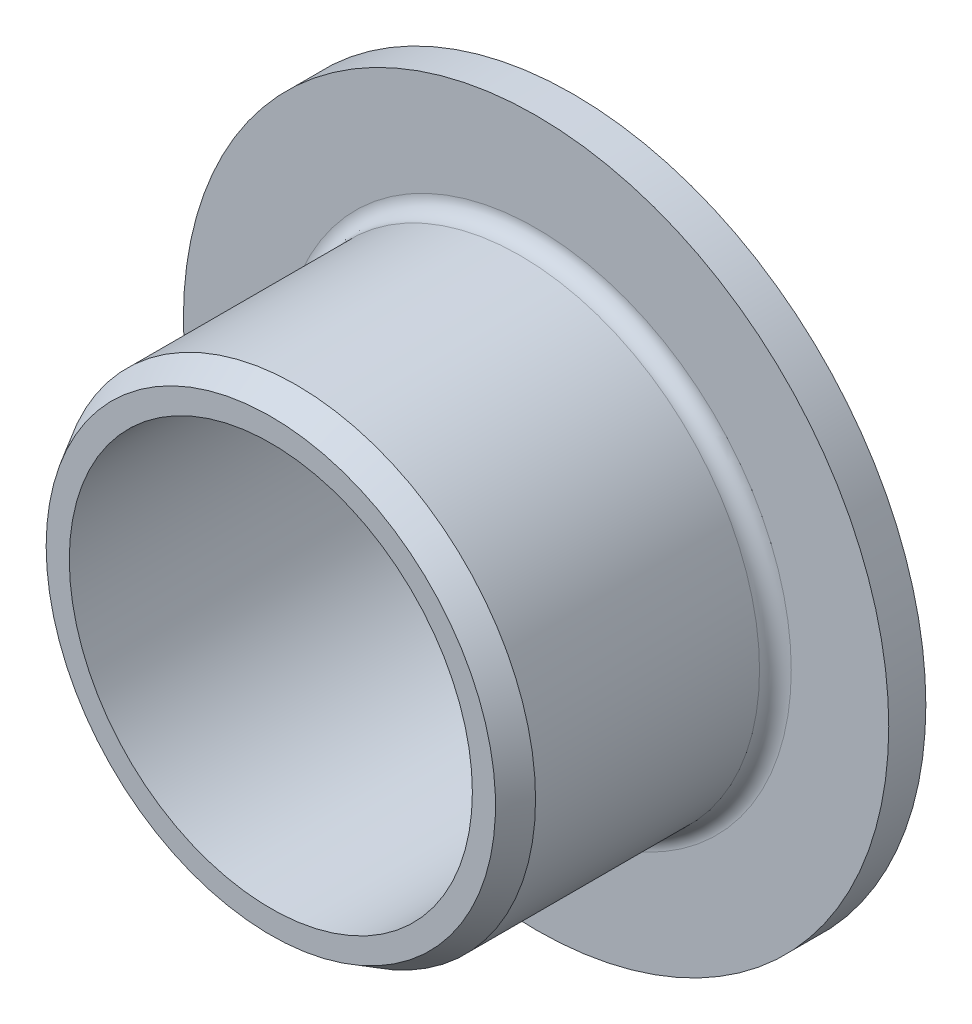
ISO-10303-21;
HEADER;
FILE_DESCRIPTION(('STEP AP214'),'2;1');
FILE_NAME('part.step','',(''),(''),'','','');
FILE_SCHEMA(('AUTOMOTIVE_DESIGN { 1 0 10303 214 1 1 1 1 }'));
ENDSEC;
DATA;
#1=APPLICATION_CONTEXT('core data for automotive mechanical design processes');
#2=APPLICATION_PROTOCOL_DEFINITION('international standard','automotive_design',2000,#1);
#3=PRODUCT_CONTEXT('',#1,'mechanical');
#4=PRODUCT('Part','Part','',(#3));
#5=PRODUCT_RELATED_PRODUCT_CATEGORY('part','',(#4));
#6=PRODUCT_DEFINITION_FORMATION('','',#4);
#7=PRODUCT_DEFINITION_CONTEXT('part definition',#1,'design');
#8=PRODUCT_DEFINITION('design','',#6,#7);
#9=PRODUCT_DEFINITION_SHAPE('','',#8);
#10=(LENGTH_UNIT() NAMED_UNIT(*) SI_UNIT(.MILLI.,.METRE.));
#11=(NAMED_UNIT(*) PLANE_ANGLE_UNIT() SI_UNIT($,.RADIAN.));
#12=(NAMED_UNIT(*) SI_UNIT($,.STERADIAN.) SOLID_ANGLE_UNIT());
#13=UNCERTAINTY_MEASURE_WITH_UNIT(LENGTH_MEASURE(1.E-05),#10,'distance_accuracy_value','');
#14=(GEOMETRIC_REPRESENTATION_CONTEXT(3) GLOBAL_UNCERTAINTY_ASSIGNED_CONTEXT((#13)) GLOBAL_UNIT_ASSIGNED_CONTEXT((#10,
#11,#12)) REPRESENTATION_CONTEXT('',''));
#15=CARTESIAN_POINT('',(0.,0.,0.));
#16=DIRECTION('',(0.,0.,1.));
#17=DIRECTION('',(1.,0.,0.));
#18=AXIS2_PLACEMENT_3D('',#15,#16,#17);
#19=CARTESIAN_POINT('',(0.,0.,1.6684));
#20=DIRECTION('',(0.,0.,-1.));
#21=DIRECTION('',(-1.,0.,0.));
#22=AXIS2_PLACEMENT_3D('',#19,#20,#21);
#23=TOROIDAL_SURFACE('',#22,8.040625,0.5);
#24=CARTESIAN_POINT('',(0.,0.,1.6684));
#25=DIRECTION('',(0.,0.,-1.));
#26=DIRECTION('',(-1.,0.,0.));
#27=AXIS2_PLACEMENT_3D('',#24,#25,#26);
#28=CIRCLE('',#27,7.540625);
#29=CARTESIAN_POINT('',(-7.540625,0.,1.6684));
#30=VERTEX_POINT('',#29);
#31=EDGE_CURVE('E59',#30,#30,#28,.T.);
#32=ORIENTED_EDGE('',*,*,#31,.T.);
#33=EDGE_LOOP('',(#32));
#34=FACE_BOUND('',#33,.T.);
#35=CARTESIAN_POINT('',(0.,0.,1.1684));
#36=DIRECTION('',(0.,0.,-1.));
#37=DIRECTION('',(-1.,0.,0.));
#38=AXIS2_PLACEMENT_3D('',#35,#36,#37);
#39=CIRCLE('',#38,8.040625);
#40=CARTESIAN_POINT('',(-8.040625,0.,1.1684));
#41=VERTEX_POINT('',#40);
#42=EDGE_CURVE('E10',#41,#41,#39,.T.);
#43=ORIENTED_EDGE('',*,*,#42,.F.);
#44=EDGE_LOOP('',(#43));
#45=FACE_BOUND('',#44,.T.);
#46=ADVANCED_FACE('F31',(#34,#45),#23,.F.);
#47=CARTESIAN_POINT('',(11.1125,0.,1.1684));
#48=DIRECTION('',(0.,0.,1.));
#49=DIRECTION('',(1.,0.,0.));
#50=AXIS2_PLACEMENT_3D('',#47,#48,#49);
#51=PLANE('',#50);
#52=ORIENTED_EDGE('',*,*,#42,.T.);
#53=EDGE_LOOP('',(#52));
#54=FACE_BOUND('',#53,.T.);
#55=CARTESIAN_POINT('',(0.,0.,1.1684));
#56=DIRECTION('',(0.,0.,-1.));
#57=DIRECTION('',(-1.,0.,0.));
#58=AXIS2_PLACEMENT_3D('',#55,#56,#57);
#59=CIRCLE('',#58,11.1125);
#60=CARTESIAN_POINT('',(-11.1125,0.,1.1684));
#61=VERTEX_POINT('',#60);
#62=EDGE_CURVE('E37',#61,#61,#59,.T.);
#63=ORIENTED_EDGE('',*,*,#62,.F.);
#64=EDGE_LOOP('',(#63));
#65=FACE_BOUND('',#64,.T.);
#66=ADVANCED_FACE('F77',(#54,#65),#51,.T.);
#67=CARTESIAN_POINT('',(0.,0.,9.525));
#68=DIRECTION('',(0.,0.,-1.));
#69=DIRECTION('',(-1.,0.,0.));
#70=AXIS2_PLACEMENT_3D('',#67,#68,#69);
#71=CYLINDRICAL_SURFACE('',#70,11.1125);
#72=ORIENTED_EDGE('',*,*,#62,.T.);
#73=EDGE_LOOP('',(#72));
#74=FACE_BOUND('',#73,.T.);
#75=CARTESIAN_POINT('',(0.,0.,0.));
#76=DIRECTION('',(0.,0.,-1.));
#77=DIRECTION('',(-1.,0.,0.));
#78=AXIS2_PLACEMENT_3D('',#75,#76,#77);
#79=CIRCLE('',#78,11.1125);
#80=CARTESIAN_POINT('',(-11.1125,0.,0.));
#81=VERTEX_POINT('',#80);
#82=EDGE_CURVE('E41',#81,#81,#79,.T.);
#83=ORIENTED_EDGE('',*,*,#82,.F.);
#84=EDGE_LOOP('',(#83));
#85=FACE_BOUND('',#84,.T.);
#86=ADVANCED_FACE('F81',(#74,#85),#71,.T.);
#87=CARTESIAN_POINT('',(6.35,0.,0.));
#88=DIRECTION('',(0.,0.,-1.));
#89=DIRECTION('',(-1.,0.,0.));
#90=AXIS2_PLACEMENT_3D('',#87,#88,#89);
#91=PLANE('',#90);
#92=ORIENTED_EDGE('',*,*,#82,.T.);
#93=EDGE_LOOP('',(#92));
#94=FACE_BOUND('',#93,.T.);
#95=CARTESIAN_POINT('',(0.,0.,0.));
#96=DIRECTION('',(0.,0.,-1.));
#97=DIRECTION('',(-1.,0.,0.));
#98=AXIS2_PLACEMENT_3D('',#95,#96,#97);
#99=CIRCLE('',#98,6.35);
#100=CARTESIAN_POINT('',(-6.35,0.,0.));
#101=VERTEX_POINT('',#100);
#102=EDGE_CURVE('E45',#101,#101,#99,.T.);
#103=ORIENTED_EDGE('',*,*,#102,.F.);
#104=EDGE_LOOP('',(#103));
#105=FACE_BOUND('',#104,.T.);
#106=ADVANCED_FACE('F85',(#94,#105),#91,.T.);
#107=CARTESIAN_POINT('',(0.,0.,9.525));
#108=DIRECTION('',(0.,0.,-1.));
#109=DIRECTION('',(-1.,0.,0.));
#110=AXIS2_PLACEMENT_3D('',#107,#108,#109);
#111=CYLINDRICAL_SURFACE('',#110,6.35);
#112=ORIENTED_EDGE('',*,*,#102,.T.);
#113=EDGE_LOOP('',(#112));
#114=FACE_BOUND('',#113,.T.);
#115=CARTESIAN_POINT('',(0.,0.,9.525));
#116=DIRECTION('',(0.,0.,-1.));
#117=DIRECTION('',(-1.,0.,0.));
#118=AXIS2_PLACEMENT_3D('',#115,#116,#117);
#119=CIRCLE('',#118,6.35);
#120=CARTESIAN_POINT('',(-6.35,0.,9.525));
#121=VERTEX_POINT('',#120);
#122=EDGE_CURVE('E50',#121,#121,#119,.T.);
#123=ORIENTED_EDGE('',*,*,#122,.F.);
#124=EDGE_LOOP('',(#123));
#125=FACE_BOUND('',#124,.T.);
#126=ADVANCED_FACE('F91',(#114,#125),#111,.F.);
#127=CARTESIAN_POINT('',(7.0787447846483,0.,9.525));
#128=DIRECTION('',(0.,0.,1.));
#129=DIRECTION('',(1.,0.,0.));
#130=AXIS2_PLACEMENT_3D('',#127,#128,#129);
#131=PLANE('',#130);
#132=ORIENTED_EDGE('',*,*,#122,.T.);
#133=EDGE_LOOP('',(#132));
#134=FACE_BOUND('',#133,.T.);
#135=CARTESIAN_POINT('',(0.,0.,9.525));
#136=DIRECTION('',(0.,0.,-1.));
#137=DIRECTION('',(-1.,0.,0.));
#138=AXIS2_PLACEMENT_3D('',#135,#136,#137);
#139=CIRCLE('',#138,7.0787447846483);
#140=CARTESIAN_POINT('',(-7.0787447846483,0.,9.525));
#141=VERTEX_POINT('',#140);
#142=EDGE_CURVE('E53',#141,#141,#139,.T.);
#143=ORIENTED_EDGE('',*,*,#142,.F.);
#144=EDGE_LOOP('',(#143));
#145=FACE_BOUND('',#144,.T.);
#146=ADVANCED_FACE('F73',(#134,#145),#131,.T.);
#147=CARTESIAN_POINT('',(0.,0.,8.725));
#148=DIRECTION('',(0.,0.,-1.));
#149=DIRECTION('',(-1.,0.,0.));
#150=AXIS2_PLACEMENT_3D('',#147,#148,#149);
#151=CONICAL_SURFACE('',#150,7.540625,0.523598775598299);
#152=ORIENTED_EDGE('',*,*,#142,.T.);
#153=EDGE_LOOP('',(#152));
#154=FACE_BOUND('',#153,.T.);
#155=CARTESIAN_POINT('',(0.,0.,8.725));
#156=DIRECTION('',(0.,0.,-1.));
#157=DIRECTION('',(-1.,0.,0.));
#158=AXIS2_PLACEMENT_3D('',#155,#156,#157);
#159=CIRCLE('',#158,7.540625);
#160=CARTESIAN_POINT('',(-7.540625,0.,8.725));
#161=VERTEX_POINT('',#160);
#162=EDGE_CURVE('E56',#161,#161,#159,.T.);
#163=ORIENTED_EDGE('',*,*,#162,.F.);
#164=EDGE_LOOP('',(#163));
#165=FACE_BOUND('',#164,.T.);
#166=ADVANCED_FACE('F67',(#154,#165),#151,.T.);
#167=CARTESIAN_POINT('',(0.,0.,9.525));
#168=DIRECTION('',(0.,0.,-1.));
#169=DIRECTION('',(-1.,0.,0.));
#170=AXIS2_PLACEMENT_3D('',#167,#168,#169);
#171=CYLINDRICAL_SURFACE('',#170,7.540625);
#172=ORIENTED_EDGE('',*,*,#162,.T.);
#173=EDGE_LOOP('',(#172));
#174=FACE_BOUND('',#173,.T.);
#175=ORIENTED_EDGE('',*,*,#31,.F.);
#176=EDGE_LOOP('',(#175));
#177=FACE_BOUND('',#176,.T.);
#178=ADVANCED_FACE('F65',(#174,#177),#171,.T.);
#179=CLOSED_SHELL('',(#46,#66,#86,#106,#126,#146,#166,#178));
#180=MANIFOLD_SOLID_BREP('B2',#179);
#181=ADVANCED_BREP_SHAPE_REPRESENTATION('',(#18,#180),#14);
#182=SHAPE_DEFINITION_REPRESENTATION(#9,#181);
ENDSEC;
END-ISO-10303-21;
